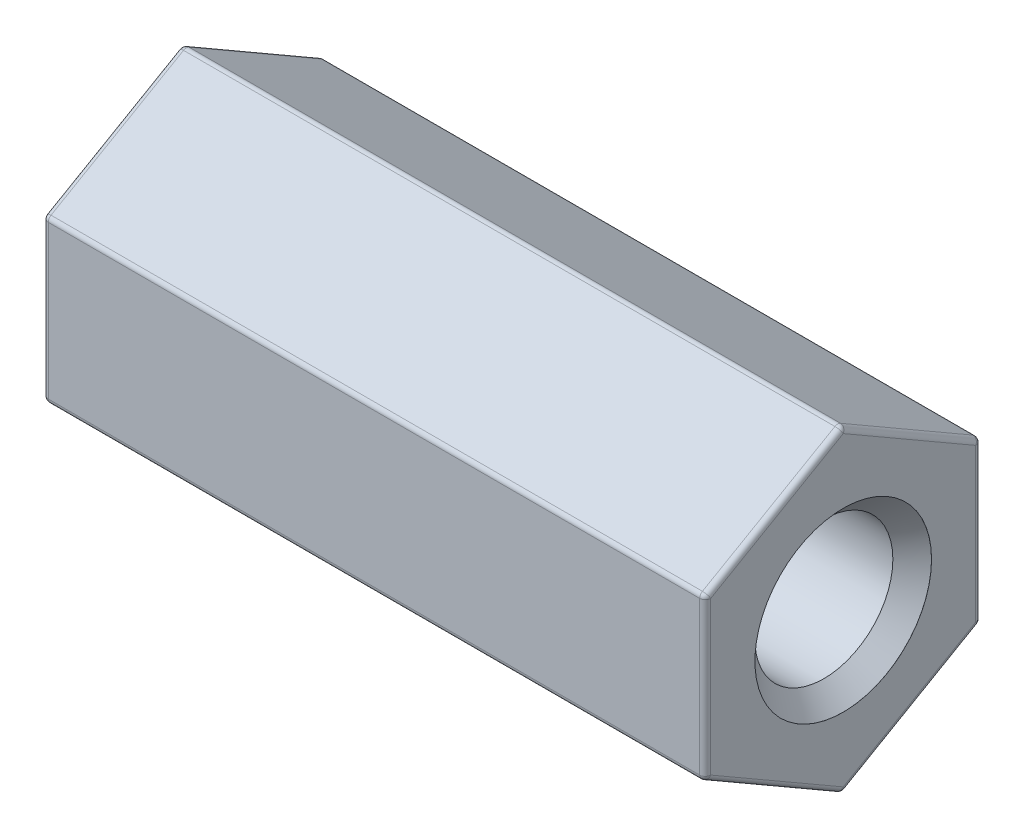
ISO-10303-21;
HEADER;
FILE_DESCRIPTION(('STEP AP214'),'2;1');
FILE_NAME('part.step','',(''),(''),'','','');
FILE_SCHEMA(('AUTOMOTIVE_DESIGN { 1 0 10303 214 1 1 1 1 }'));
ENDSEC;
DATA;
#1=APPLICATION_CONTEXT('core data for automotive mechanical design processes');
#2=APPLICATION_PROTOCOL_DEFINITION('international standard','automotive_design',2000,#1);
#3=PRODUCT_CONTEXT('',#1,'mechanical');
#4=PRODUCT('Part','Part','',(#3));
#5=PRODUCT_RELATED_PRODUCT_CATEGORY('part','',(#4));
#6=PRODUCT_DEFINITION_FORMATION('','',#4);
#7=PRODUCT_DEFINITION_CONTEXT('part definition',#1,'design');
#8=PRODUCT_DEFINITION('design','',#6,#7);
#9=PRODUCT_DEFINITION_SHAPE('','',#8);
#10=(LENGTH_UNIT() NAMED_UNIT(*) SI_UNIT(.MILLI.,.METRE.));
#11=(NAMED_UNIT(*) PLANE_ANGLE_UNIT() SI_UNIT($,.RADIAN.));
#12=(NAMED_UNIT(*) SI_UNIT($,.STERADIAN.) SOLID_ANGLE_UNIT());
#13=UNCERTAINTY_MEASURE_WITH_UNIT(LENGTH_MEASURE(1.E-05),#10,'distance_accuracy_value','');
#14=(GEOMETRIC_REPRESENTATION_CONTEXT(3) GLOBAL_UNCERTAINTY_ASSIGNED_CONTEXT((#13)) GLOBAL_UNIT_ASSIGNED_CONTEXT((#10,
#11,#12)) REPRESENTATION_CONTEXT('',''));
#15=CARTESIAN_POINT('',(0.,0.,0.));
#16=DIRECTION('',(0.,0.,1.));
#17=DIRECTION('',(1.,0.,0.));
#18=AXIS2_PLACEMENT_3D('',#15,#16,#17);
#19=CARTESIAN_POINT('',(0.,2.88675134594813,0.));
#20=DIRECTION('',(0.,0.866025403784439,0.5));
#21=DIRECTION('',(0.,-0.5,0.866025403784439));
#22=AXIS2_PLACEMENT_3D('',#19,#20,#21);
#23=PLANE('',#22);
#24=DIRECTION('',(1.,0.,0.));
#25=VECTOR('',#24,1.);
#26=CARTESIAN_POINT('',(0.,1.47224318643355,2.45));
#27=LINE('',#26,#25);
#28=CARTESIAN_POINT('',(0.0999999999999998,1.47224318643355,2.45));
#29=VERTEX_POINT('',#28);
#30=CARTESIAN_POINT('',(11.9,1.47224318643355,2.45));
#31=VERTEX_POINT('',#30);
#32=EDGE_CURVE('E256',#29,#31,#27,.T.);
#33=ORIENTED_EDGE('',*,*,#32,.T.);
#34=DIRECTION('',(0.,-0.5,0.866025403784439));
#35=VECTOR('',#34,1.);
#36=CARTESIAN_POINT('',(11.9,2.88675134594813,0.));
#37=LINE('',#36,#35);
#38=CARTESIAN_POINT('',(11.9,2.85788383248865,0.0499999999999996));
#39=VERTEX_POINT('',#38);
#40=EDGE_CURVE('E175',#31,#39,#37,.F.);
#41=ORIENTED_EDGE('',*,*,#40,.T.);
#42=DIRECTION('',(1.,0.,0.));
#43=VECTOR('',#42,1.);
#44=CARTESIAN_POINT('',(0.,2.85788383248865,0.0499999999999996));
#45=LINE('',#44,#43);
#46=CARTESIAN_POINT('',(0.0999999999999998,2.85788383248865,0.0499999999999996));
#47=VERTEX_POINT('',#46);
#48=EDGE_CURVE('E258',#39,#47,#45,.F.);
#49=ORIENTED_EDGE('',*,*,#48,.T.);
#50=DIRECTION('',(0.,-0.5,0.866025403784439));
#51=VECTOR('',#50,1.);
#52=CARTESIAN_POINT('',(0.0999999999999998,1.44337567297407,2.5));
#53=LINE('',#52,#51);
#54=EDGE_CURVE('E254',#47,#29,#53,.T.);
#55=ORIENTED_EDGE('',*,*,#54,.T.);
#56=EDGE_LOOP('',(#33,#41,#49,#55));
#57=FACE_BOUND('',#56,.T.);
#58=ADVANCED_FACE('F32',(#57),#23,.T.);
#59=CARTESIAN_POINT('',(0.,1.44337567297407,-2.5));
#60=DIRECTION('',(0.,0.866025403784439,-0.5));
#61=DIRECTION('',(0.,0.5,0.866025403784439));
#62=AXIS2_PLACEMENT_3D('',#59,#60,#61);
#63=PLANE('',#62);
#64=DIRECTION('',(1.,0.,0.));
#65=VECTOR('',#64,1.);
#66=CARTESIAN_POINT('',(0.,2.85788383248865,-0.0499999999999997));
#67=LINE('',#66,#65);
#68=CARTESIAN_POINT('',(0.0999999999999998,2.85788383248865,-0.0499999999999998));
#69=VERTEX_POINT('',#68);
#70=CARTESIAN_POINT('',(11.9,2.85788383248865,-0.0499999999999998));
#71=VERTEX_POINT('',#70);
#72=EDGE_CURVE('E247',#69,#71,#67,.T.);
#73=ORIENTED_EDGE('',*,*,#72,.T.);
#74=DIRECTION('',(0.,0.5,0.866025403784439));
#75=VECTOR('',#74,1.);
#76=CARTESIAN_POINT('',(11.9,1.44337567297407,-2.5));
#77=LINE('',#76,#75);
#78=CARTESIAN_POINT('',(11.9,1.47224318643355,-2.45));
#79=VERTEX_POINT('',#78);
#80=EDGE_CURVE('E251',#71,#79,#77,.F.);
#81=ORIENTED_EDGE('',*,*,#80,.T.);
#82=DIRECTION('',(1.,0.,0.));
#83=VECTOR('',#82,1.);
#84=CARTESIAN_POINT('',(0.,1.47224318643355,-2.45));
#85=LINE('',#84,#83);
#86=CARTESIAN_POINT('',(0.0999999999999998,1.47224318643355,-2.45));
#87=VERTEX_POINT('',#86);
#88=EDGE_CURVE('E249',#79,#87,#85,.F.);
#89=ORIENTED_EDGE('',*,*,#88,.T.);
#90=DIRECTION('',(0.,0.5,0.866025403784439));
#91=VECTOR('',#90,1.);
#92=CARTESIAN_POINT('',(0.0999999999999998,2.88675134594813,0.));
#93=LINE('',#92,#91);
#94=EDGE_CURVE('E245',#87,#69,#93,.T.);
#95=ORIENTED_EDGE('',*,*,#94,.T.);
#96=EDGE_LOOP('',(#73,#81,#89,#95));
#97=FACE_BOUND('',#96,.T.);
#98=ADVANCED_FACE('F390',(#97),#63,.T.);
#99=CARTESIAN_POINT('',(0.,-1.44337567297407,-2.5));
#100=DIRECTION('',(0.,0.,-1.));
#101=DIRECTION('',(0.,1.,0.));
#102=AXIS2_PLACEMENT_3D('',#99,#100,#101);
#103=PLANE('',#102);
#104=DIRECTION('',(1.,0.,0.));
#105=VECTOR('',#104,1.);
#106=CARTESIAN_POINT('',(0.,1.3856406460551,-2.5));
#107=LINE('',#106,#105);
#108=CARTESIAN_POINT('',(0.0999999999999998,1.3856406460551,-2.5));
#109=VERTEX_POINT('',#108);
#110=CARTESIAN_POINT('',(11.9,1.3856406460551,-2.5));
#111=VERTEX_POINT('',#110);
#112=EDGE_CURVE('E216',#109,#111,#107,.T.);
#113=ORIENTED_EDGE('',*,*,#112,.T.);
#114=DIRECTION('',(0.,1.,0.));
#115=VECTOR('',#114,1.);
#116=CARTESIAN_POINT('',(11.9,-1.44337567297407,-2.5));
#117=LINE('',#116,#115);
#118=CARTESIAN_POINT('',(11.9,-1.3856406460551,-2.5));
#119=VERTEX_POINT('',#118);
#120=EDGE_CURVE('E220',#111,#119,#117,.F.);
#121=ORIENTED_EDGE('',*,*,#120,.T.);
#122=DIRECTION('',(1.,0.,0.));
#123=VECTOR('',#122,1.);
#124=CARTESIAN_POINT('',(0.,-1.3856406460551,-2.5));
#125=LINE('',#124,#123);
#126=CARTESIAN_POINT('',(0.0999999999999998,-1.3856406460551,-2.5));
#127=VERTEX_POINT('',#126);
#128=EDGE_CURVE('E218',#119,#127,#125,.F.);
#129=ORIENTED_EDGE('',*,*,#128,.T.);
#130=DIRECTION('',(0.,1.,0.));
#131=VECTOR('',#130,1.);
#132=CARTESIAN_POINT('',(0.0999999999999998,1.44337567297407,-2.5));
#133=LINE('',#132,#131);
#134=EDGE_CURVE('E214',#127,#109,#133,.T.);
#135=ORIENTED_EDGE('',*,*,#134,.T.);
#136=EDGE_LOOP('',(#113,#121,#129,#135));
#137=FACE_BOUND('',#136,.T.);
#138=ADVANCED_FACE('F396',(#137),#103,.T.);
#139=CARTESIAN_POINT('',(0.,-2.88675134594813,0.));
#140=DIRECTION('',(0.,-0.866025403784439,-0.5));
#141=DIRECTION('',(0.,0.5,-0.866025403784439));
#142=AXIS2_PLACEMENT_3D('',#139,#140,#141);
#143=PLANE('',#142);
#144=DIRECTION('',(1.,0.,0.));
#145=VECTOR('',#144,1.);
#146=CARTESIAN_POINT('',(0.,-1.47224318643355,-2.45));
#147=LINE('',#146,#145);
#148=CARTESIAN_POINT('',(0.0999999999999998,-1.47224318643355,-2.45));
#149=VERTEX_POINT('',#148);
#150=CARTESIAN_POINT('',(11.9,-1.47224318643355,-2.45));
#151=VERTEX_POINT('',#150);
#152=EDGE_CURVE('E209',#149,#151,#147,.T.);
#153=ORIENTED_EDGE('',*,*,#152,.T.);
#154=DIRECTION('',(0.,0.5,-0.866025403784439));
#155=VECTOR('',#154,1.);
#156=CARTESIAN_POINT('',(11.9,-2.88675134594813,0.));
#157=LINE('',#156,#155);
#158=CARTESIAN_POINT('',(11.9,-2.85788383248865,-0.0499999999999996));
#159=VERTEX_POINT('',#158);
#160=EDGE_CURVE('E211',#151,#159,#157,.F.);
#161=ORIENTED_EDGE('',*,*,#160,.T.);
#162=DIRECTION('',(1.,0.,0.));
#163=VECTOR('',#162,1.);
#164=CARTESIAN_POINT('',(0.,-2.85788383248865,-0.0499999999999996));
#165=LINE('',#164,#163);
#166=CARTESIAN_POINT('',(0.0999999999999998,-2.85788383248865,-0.0499999999999997));
#167=VERTEX_POINT('',#166);
#168=EDGE_CURVE('E207',#159,#167,#165,.F.);
#169=ORIENTED_EDGE('',*,*,#168,.T.);
#170=DIRECTION('',(0.,0.5,-0.866025403784439));
#171=VECTOR('',#170,1.);
#172=CARTESIAN_POINT('',(0.0999999999999998,-1.44337567297407,-2.5));
#173=LINE('',#172,#171);
#174=EDGE_CURVE('E205',#167,#149,#173,.T.);
#175=ORIENTED_EDGE('',*,*,#174,.T.);
#176=EDGE_LOOP('',(#153,#161,#169,#175));
#177=FACE_BOUND('',#176,.T.);
#178=ADVANCED_FACE('F568',(#177),#143,.T.);
#179=CARTESIAN_POINT('',(0.,-1.44337567297407,2.5));
#180=DIRECTION('',(0.,-0.866025403784439,0.5));
#181=DIRECTION('',(0.,-0.5,-0.866025403784439));
#182=AXIS2_PLACEMENT_3D('',#179,#180,#181);
#183=PLANE('',#182);
#184=DIRECTION('',(1.,0.,0.));
#185=VECTOR('',#184,1.);
#186=CARTESIAN_POINT('',(0.,-2.85788383248865,0.0500000000000001));
#187=LINE('',#186,#185);
#188=CARTESIAN_POINT('',(0.0999999999999998,-2.85788383248865,0.0500000000000002));
#189=VERTEX_POINT('',#188);
#190=CARTESIAN_POINT('',(11.9,-2.85788383248865,0.0500000000000002));
#191=VERTEX_POINT('',#190);
#192=EDGE_CURVE('E227',#189,#191,#187,.T.);
#193=ORIENTED_EDGE('',*,*,#192,.T.);
#194=DIRECTION('',(0.,-0.5,-0.866025403784439));
#195=VECTOR('',#194,1.);
#196=CARTESIAN_POINT('',(11.9,-1.44337567297407,2.5));
#197=LINE('',#196,#195);
#198=CARTESIAN_POINT('',(11.9,-1.47224318643355,2.45));
#199=VERTEX_POINT('',#198);
#200=EDGE_CURVE('E229',#191,#199,#197,.F.);
#201=ORIENTED_EDGE('',*,*,#200,.T.);
#202=DIRECTION('',(1.,0.,0.));
#203=VECTOR('',#202,1.);
#204=CARTESIAN_POINT('',(0.,-1.47224318643355,2.45));
#205=LINE('',#204,#203);
#206=CARTESIAN_POINT('',(0.0999999999999998,-1.47224318643355,2.45));
#207=VERTEX_POINT('',#206);
#208=EDGE_CURVE('E225',#199,#207,#205,.F.);
#209=ORIENTED_EDGE('',*,*,#208,.T.);
#210=DIRECTION('',(0.,-0.5,-0.866025403784439));
#211=VECTOR('',#210,1.);
#212=CARTESIAN_POINT('',(0.0999999999999998,-2.88675134594813,0.));
#213=LINE('',#212,#211);
#214=EDGE_CURVE('E223',#207,#189,#213,.T.);
#215=ORIENTED_EDGE('',*,*,#214,.T.);
#216=EDGE_LOOP('',(#193,#201,#209,#215));
#217=FACE_BOUND('',#216,.T.);
#218=ADVANCED_FACE('F529',(#217),#183,.T.);
#219=CARTESIAN_POINT('',(0.,1.44337567297407,2.5));
#220=DIRECTION('',(0.,0.,1.));
#221=DIRECTION('',(1.,0.,0.));
#222=AXIS2_PLACEMENT_3D('',#219,#220,#221);
#223=PLANE('',#222);
#224=DIRECTION('',(1.,0.,0.));
#225=VECTOR('',#224,1.);
#226=CARTESIAN_POINT('',(0.,-1.3856406460551,2.5));
#227=LINE('',#226,#225);
#228=CARTESIAN_POINT('',(0.0999999999999998,-1.3856406460551,2.5));
#229=VERTEX_POINT('',#228);
#230=CARTESIAN_POINT('',(11.9,-1.3856406460551,2.5));
#231=VERTEX_POINT('',#230);
#232=EDGE_CURVE('E41',#229,#231,#227,.T.);
#233=ORIENTED_EDGE('',*,*,#232,.T.);
#234=DIRECTION('',(0.,-1.,0.));
#235=VECTOR('',#234,1.);
#236=CARTESIAN_POINT('',(11.9,1.44337567297407,2.5));
#237=LINE('',#236,#235);
#238=CARTESIAN_POINT('',(11.9,1.3856406460551,2.5));
#239=VERTEX_POINT('',#238);
#240=EDGE_CURVE('E11',#231,#239,#237,.F.);
#241=ORIENTED_EDGE('',*,*,#240,.T.);
#242=DIRECTION('',(1.,0.,0.));
#243=VECTOR('',#242,1.);
#244=CARTESIAN_POINT('',(0.,1.3856406460551,2.5));
#245=LINE('',#244,#243);
#246=CARTESIAN_POINT('',(0.0999999999999998,1.3856406460551,2.5));
#247=VERTEX_POINT('',#246);
#248=EDGE_CURVE('E263',#239,#247,#245,.F.);
#249=ORIENTED_EDGE('',*,*,#248,.T.);
#250=DIRECTION('',(0.,-1.,0.));
#251=VECTOR('',#250,1.);
#252=CARTESIAN_POINT('',(0.0999999999999998,-1.44337567297407,2.5));
#253=LINE('',#252,#251);
#254=EDGE_CURVE('E261',#247,#229,#253,.T.);
#255=ORIENTED_EDGE('',*,*,#254,.T.);
#256=EDGE_LOOP('',(#233,#241,#249,#255));
#257=FACE_BOUND('',#256,.T.);
#258=ADVANCED_FACE('F385',(#257),#223,.T.);
#259=CARTESIAN_POINT('',(0.,0.,0.));
#260=DIRECTION('',(1.,0.,0.));
#261=DIRECTION('',(0.,0.,-1.));
#262=AXIS2_PLACEMENT_3D('',#259,#260,#261);
#263=PLANE('',#262);
#264=DIRECTION('',(0.,1.,0.));
#265=VECTOR('',#264,1.);
#266=CARTESIAN_POINT('',(0.,-1.44337567297407,-2.4));
#267=LINE('',#266,#265);
#268=CARTESIAN_POINT('',(0.,1.3856406460551,-2.4));
#269=VERTEX_POINT('',#268);
#270=CARTESIAN_POINT('',(0.,-1.3856406460551,-2.4));
#271=VERTEX_POINT('',#270);
#272=EDGE_CURVE('E240',#269,#271,#267,.F.);
#273=ORIENTED_EDGE('',*,*,#272,.T.);
#274=DIRECTION('',(0.,0.5,-0.866025403784439));
#275=VECTOR('',#274,1.);
#276=CARTESIAN_POINT('',(0.,-2.80014880556969,0.0499999999999999));
#277=LINE('',#276,#275);
#278=CARTESIAN_POINT('',(0.,-2.77128129211021,0.));
#279=VERTEX_POINT('',#278);
#280=EDGE_CURVE('E242',#271,#279,#277,.F.);
#281=ORIENTED_EDGE('',*,*,#280,.T.);
#282=DIRECTION('',(0.,-0.5,-0.866025403784439));
#283=VECTOR('',#282,1.);
#284=CARTESIAN_POINT('',(0.,-1.35677313259562,2.45));
#285=LINE('',#284,#283);
#286=CARTESIAN_POINT('',(0.,-1.3856406460551,2.4));
#287=VERTEX_POINT('',#286);
#288=EDGE_CURVE('E238',#279,#287,#285,.F.);
#289=ORIENTED_EDGE('',*,*,#288,.T.);
#290=DIRECTION('',(0.,-1.,0.));
#291=VECTOR('',#290,1.);
#292=CARTESIAN_POINT('',(0.,1.44337567297407,2.4));
#293=LINE('',#292,#291);
#294=CARTESIAN_POINT('',(0.,1.3856406460551,2.4));
#295=VERTEX_POINT('',#294);
#296=EDGE_CURVE('E234',#287,#295,#293,.F.);
#297=ORIENTED_EDGE('',*,*,#296,.T.);
#298=DIRECTION('',(0.,-0.5,0.866025403784439));
#299=VECTOR('',#298,1.);
#300=CARTESIAN_POINT('',(0.,2.80014880556969,-0.0500000000000002));
#301=LINE('',#300,#299);
#302=CARTESIAN_POINT('',(0.,2.77128129211021,0.));
#303=VERTEX_POINT('',#302);
#304=EDGE_CURVE('E232',#295,#303,#301,.F.);
#305=ORIENTED_EDGE('',*,*,#304,.T.);
#306=DIRECTION('',(0.,0.5,0.866025403784439));
#307=VECTOR('',#306,1.);
#308=CARTESIAN_POINT('',(0.,1.35677313259562,-2.45));
#309=LINE('',#308,#307);
#310=EDGE_CURVE('E236',#303,#269,#309,.F.);
#311=ORIENTED_EDGE('',*,*,#310,.T.);
#312=EDGE_LOOP('',(#273,#281,#289,#297,#305,#311));
#313=FACE_BOUND('',#312,.T.);
#314=CARTESIAN_POINT('',(0.,5.31141630952036E-11,0.));
#315=DIRECTION('',(1.,0.,0.));
#316=DIRECTION('',(0.,0.,-1.));
#317=AXIS2_PLACEMENT_3D('',#314,#315,#316);
#318=CIRCLE('',#317,1.6);
#319=CARTESIAN_POINT('',(0.,5.31141630952036E-11,-1.6));
#320=VERTEX_POINT('',#319);
#321=EDGE_CURVE('E190',#320,#320,#318,.T.);
#322=ORIENTED_EDGE('',*,*,#321,.T.);
#323=EDGE_LOOP('',(#322));
#324=FACE_BOUND('',#323,.T.);
#325=ADVANCED_FACE('F377',(#313,#324),#263,.F.);
#326=CARTESIAN_POINT('',(12.,0.,0.));
#327=DIRECTION('',(1.,0.,0.));
#328=DIRECTION('',(0.,0.,-1.));
#329=AXIS2_PLACEMENT_3D('',#326,#327,#328);
#330=PLANE('',#329);
#331=DIRECTION('',(0.,-0.5,-0.866025403784439));
#332=VECTOR('',#331,1.);
#333=CARTESIAN_POINT('',(12.,-2.07846096908265,1.2));
#334=LINE('',#333,#332);
#335=CARTESIAN_POINT('',(12.,-1.3856406460551,2.4));
#336=VERTEX_POINT('',#335);
#337=CARTESIAN_POINT('',(12.,-2.77128129211021,0.));
#338=VERTEX_POINT('',#337);
#339=EDGE_CURVE('E198',#336,#338,#334,.T.);
#340=ORIENTED_EDGE('',*,*,#339,.T.);
#341=DIRECTION('',(0.,0.5,-0.866025403784439));
#342=VECTOR('',#341,1.);
#343=CARTESIAN_POINT('',(12.,-2.07846096908265,-1.2));
#344=LINE('',#343,#342);
#345=CARTESIAN_POINT('',(12.,-1.3856406460551,-2.4));
#346=VERTEX_POINT('',#345);
#347=EDGE_CURVE('E202',#338,#346,#344,.T.);
#348=ORIENTED_EDGE('',*,*,#347,.T.);
#349=DIRECTION('',(0.,1.,0.));
#350=VECTOR('',#349,1.);
#351=CARTESIAN_POINT('',(12.,0.,-2.4));
#352=LINE('',#351,#350);
#353=CARTESIAN_POINT('',(12.,1.3856406460551,-2.4));
#354=VERTEX_POINT('',#353);
#355=EDGE_CURVE('E200',#346,#354,#352,.T.);
#356=ORIENTED_EDGE('',*,*,#355,.T.);
#357=DIRECTION('',(0.,0.5,0.866025403784439));
#358=VECTOR('',#357,1.);
#359=CARTESIAN_POINT('',(12.,2.07846096908265,-1.2));
#360=LINE('',#359,#358);
#361=CARTESIAN_POINT('',(12.,2.77128129211021,0.));
#362=VERTEX_POINT('',#361);
#363=EDGE_CURVE('E165',#354,#362,#360,.T.);
#364=ORIENTED_EDGE('',*,*,#363,.T.);
#365=DIRECTION('',(0.,-0.5,0.866025403784439));
#366=VECTOR('',#365,1.);
#367=CARTESIAN_POINT('',(12.,2.07846096908265,1.2));
#368=LINE('',#367,#366);
#369=CARTESIAN_POINT('',(12.,1.3856406460551,2.4));
#370=VERTEX_POINT('',#369);
#371=EDGE_CURVE('E158',#362,#370,#368,.T.);
#372=ORIENTED_EDGE('',*,*,#371,.T.);
#373=DIRECTION('',(0.,-1.,0.));
#374=VECTOR('',#373,1.);
#375=CARTESIAN_POINT('',(12.,0.,2.4));
#376=LINE('',#375,#374);
#377=EDGE_CURVE('E162',#370,#336,#376,.T.);
#378=ORIENTED_EDGE('',*,*,#377,.T.);
#379=EDGE_LOOP('',(#340,#348,#356,#364,#372,#378));
#380=FACE_BOUND('',#379,.T.);
#381=CARTESIAN_POINT('',(12.,5.31141630952036E-11,0.));
#382=DIRECTION('',(1.,0.,0.));
#383=DIRECTION('',(0.,0.,-1.));
#384=AXIS2_PLACEMENT_3D('',#381,#382,#383);
#385=CIRCLE('',#384,1.6);
#386=CARTESIAN_POINT('',(12.,5.31141630952036E-11,-1.6));
#387=VERTEX_POINT('',#386);
#388=EDGE_CURVE('E193',#387,#387,#385,.T.);
#389=ORIENTED_EDGE('',*,*,#388,.F.);
#390=EDGE_LOOP('',(#389));
#391=FACE_BOUND('',#390,.T.);
#392=ADVANCED_FACE('F160',(#380,#391),#330,.T.);
#393=CARTESIAN_POINT('',(0.,5.31141630952036E-11,0.));
#394=DIRECTION('',(1.,0.,0.));
#395=DIRECTION('',(0.,0.,-1.));
#396=AXIS2_PLACEMENT_3D('',#393,#394,#395);
#397=CYLINDRICAL_SURFACE('',#396,1.6);
#398=ORIENTED_EDGE('',*,*,#321,.F.);
#399=EDGE_LOOP('',(#398));
#400=FACE_BOUND('',#399,.T.);
#401=CARTESIAN_POINT('',(0.00100000005431823,5.31141630952036E-11,0.));
#402=DIRECTION('',(1.,0.,0.));
#403=DIRECTION('',(0.,0.,-1.));
#404=AXIS2_PLACEMENT_3D('',#401,#402,#403);
#405=CIRCLE('',#404,1.6);
#406=CARTESIAN_POINT('',(0.00100000005431823,5.31141630952036E-11,-1.6));
#407=VERTEX_POINT('',#406);
#408=EDGE_CURVE('E353',#407,#407,#405,.T.);
#409=ORIENTED_EDGE('',*,*,#408,.T.);
#410=EDGE_LOOP('',(#409));
#411=FACE_BOUND('',#410,.T.);
#412=ADVANCED_FACE('F376',(#400,#411),#397,.F.);
#413=CARTESIAN_POINT('',(0.,5.31141630952036E-11,0.));
#414=DIRECTION('',(1.,0.,0.));
#415=DIRECTION('',(0.,0.,-1.));
#416=AXIS2_PLACEMENT_3D('',#413,#414,#415);
#417=CYLINDRICAL_SURFACE('',#416,1.6);
#418=CARTESIAN_POINT('',(11.9990000000818,5.31141630952036E-11,0.));
#419=DIRECTION('',(1.,0.,0.));
#420=DIRECTION('',(0.,0.,-1.));
#421=AXIS2_PLACEMENT_3D('',#418,#419,#420);
#422=CIRCLE('',#421,1.6);
#423=CARTESIAN_POINT('',(11.9990000000818,5.31141630952036E-11,-1.6));
#424=VERTEX_POINT('',#423);
#425=EDGE_CURVE('E369',#424,#424,#422,.T.);
#426=ORIENTED_EDGE('',*,*,#425,.F.);
#427=EDGE_LOOP('',(#426));
#428=FACE_BOUND('',#427,.T.);
#429=ORIENTED_EDGE('',*,*,#388,.T.);
#430=EDGE_LOOP('',(#429));
#431=FACE_BOUND('',#430,.T.);
#432=ADVANCED_FACE('F374',(#428,#431),#417,.F.);
#433=CARTESIAN_POINT('',(11.9990000000818,5.31141630952036E-11,0.));
#434=DIRECTION('',(1.,0.,0.));
#435=DIRECTION('',(0.,0.,-1.));
#436=AXIS2_PLACEMENT_3D('',#433,#434,#435);
#437=CONICAL_SURFACE('',#436,1.6,0.785398163356525);
#438=CARTESIAN_POINT('',(11.6490000000537,5.31141630952036E-11,0.));
#439=DIRECTION('',(1.,0.,0.));
#440=DIRECTION('',(0.,0.,-1.));
#441=AXIS2_PLACEMENT_3D('',#438,#439,#440);
#442=CIRCLE('',#441,1.2500000000006);
#443=CARTESIAN_POINT('',(11.6490000000537,5.31141630952036E-11,-1.2500000000006));
#444=VERTEX_POINT('',#443);
#445=EDGE_CURVE('E364',#444,#444,#442,.T.);
#446=ORIENTED_EDGE('',*,*,#445,.F.);
#447=EDGE_LOOP('',(#446));
#448=FACE_BOUND('',#447,.T.);
#449=ORIENTED_EDGE('',*,*,#425,.T.);
#450=EDGE_LOOP('',(#449));
#451=FACE_BOUND('',#450,.T.);
#452=ADVANCED_FACE('F786',(#448,#451),#437,.F.);
#453=CARTESIAN_POINT('',(0.,5.31141630952036E-11,0.));
#454=DIRECTION('',(1.,0.,0.));
#455=DIRECTION('',(0.,0.,-1.));
#456=AXIS2_PLACEMENT_3D('',#453,#454,#455);
#457=CYLINDRICAL_SURFACE('',#456,1.2500000000006);
#458=CARTESIAN_POINT('',(0.351000000053722,5.31141630952036E-11,0.));
#459=DIRECTION('',(1.,0.,0.));
#460=DIRECTION('',(0.,0.,-1.));
#461=AXIS2_PLACEMENT_3D('',#458,#459,#460);
#462=CIRCLE('',#461,1.2500000000006);
#463=CARTESIAN_POINT('',(0.351000000053722,5.31141630952036E-11,-1.2500000000006));
#464=VERTEX_POINT('',#463);
#465=EDGE_CURVE('E359',#464,#464,#462,.T.);
#466=ORIENTED_EDGE('',*,*,#465,.F.);
#467=EDGE_LOOP('',(#466));
#468=FACE_BOUND('',#467,.T.);
#469=ORIENTED_EDGE('',*,*,#445,.T.);
#470=EDGE_LOOP('',(#469));
#471=FACE_BOUND('',#470,.T.);
#472=ADVANCED_FACE('F779',(#468,#471),#457,.F.);
#473=CARTESIAN_POINT('',(0.351000000053722,5.31141630952036E-11,0.));
#474=DIRECTION('',(-1.,0.,0.));
#475=DIRECTION('',(0.,0.,1.));
#476=AXIS2_PLACEMENT_3D('',#473,#474,#475);
#477=CONICAL_SURFACE('',#476,1.2500000000006,0.785398163397448);
#478=ORIENTED_EDGE('',*,*,#408,.F.);
#479=EDGE_LOOP('',(#478));
#480=FACE_BOUND('',#479,.T.);
#481=ORIENTED_EDGE('',*,*,#465,.T.);
#482=EDGE_LOOP('',(#481));
#483=FACE_BOUND('',#482,.T.);
#484=ADVANCED_FACE('F510',(#480,#483),#477,.F.);
#485=CARTESIAN_POINT('',(0.0999999999999998,2.80014880556969,-0.0500000000000002));
#486=DIRECTION('',(0.,0.5,-0.866025403784439));
#487=DIRECTION('',(0.,0.866025403784439,0.5));
#488=AXIS2_PLACEMENT_3D('',#485,#486,#487);
#489=CYLINDRICAL_SURFACE('',#488,0.0999999999999998);
#490=CARTESIAN_POINT('',(0.0999999999999998,1.3856406460551,2.4));
#491=DIRECTION('',(0.,-0.499999999999999,0.86602540378444));
#492=DIRECTION('',(0.,-0.86602540378444,-0.499999999999999));
#493=AXIS2_PLACEMENT_3D('',#490,#491,#492);
#494=CIRCLE('',#493,0.0999999999999998);
#495=EDGE_CURVE('E36',#29,#295,#494,.T.);
#496=ORIENTED_EDGE('',*,*,#495,.F.);
#497=ORIENTED_EDGE('',*,*,#54,.F.);
#498=CARTESIAN_POINT('',(0.0999999999999998,2.77128129211021,0.));
#499=DIRECTION('',(0.,0.499999999999999,-0.866025403784439));
#500=DIRECTION('',(0.,0.866025403784439,0.499999999999999));
#501=AXIS2_PLACEMENT_3D('',#498,#499,#500);
#502=CIRCLE('',#501,0.0999999999999998);
#503=EDGE_CURVE('E346',#303,#47,#502,.T.);
#504=ORIENTED_EDGE('',*,*,#503,.F.);
#505=ORIENTED_EDGE('',*,*,#304,.F.);
#506=EDGE_LOOP('',(#496,#497,#504,#505));
#507=FACE_BOUND('',#506,.T.);
#508=ADVANCED_FACE('F34',(#507),#489,.T.);
#509=CARTESIAN_POINT('',(0.0999999999999998,1.3856406460551,2.4));
#510=DIRECTION('',(0.,0.,1.));
#511=DIRECTION('',(1.,0.,0.));
#512=AXIS2_PLACEMENT_3D('',#509,#510,#511);
#513=SPHERICAL_SURFACE('',#512,0.0999999999999998);
#514=CARTESIAN_POINT('',(0.0999999999999998,1.3856406460551,2.4));
#515=DIRECTION('',(-1.,0.,0.));
#516=DIRECTION('',(0.,0.,1.));
#517=AXIS2_PLACEMENT_3D('',#514,#515,#516);
#518=CIRCLE('',#517,0.0999999999999998);
#519=EDGE_CURVE('E341',#29,#247,#518,.F.);
#520=ORIENTED_EDGE('',*,*,#519,.F.);
#521=ORIENTED_EDGE('',*,*,#495,.T.);
#522=CARTESIAN_POINT('',(0.0999999999999998,1.3856406460551,2.4));
#523=DIRECTION('',(0.,1.,0.));
#524=DIRECTION('',(0.,0.,1.));
#525=AXIS2_PLACEMENT_3D('',#522,#523,#524);
#526=CIRCLE('',#525,0.0999999999999998);
#527=EDGE_CURVE('E344',#247,#295,#526,.F.);
#528=ORIENTED_EDGE('',*,*,#527,.F.);
#529=EDGE_LOOP('',(#520,#521,#528));
#530=FACE_BOUND('',#529,.T.);
#531=ADVANCED_FACE('F505',(#530),#513,.T.);
#532=CARTESIAN_POINT('',(0.0999999999999998,2.77128129211021,0.));
#533=DIRECTION('',(0.,0.,1.));
#534=DIRECTION('',(1.,0.,0.));
#535=AXIS2_PLACEMENT_3D('',#532,#533,#534);
#536=SPHERICAL_SURFACE('',#535,0.0999999999999998);
#537=CARTESIAN_POINT('',(0.0999999999999998,2.77128129211021,0.));
#538=DIRECTION('',(0.,0.5,0.866025403784439));
#539=DIRECTION('',(0.,-0.866025403784439,0.5));
#540=AXIS2_PLACEMENT_3D('',#537,#538,#539);
#541=CIRCLE('',#540,0.0999999999999998);
#542=EDGE_CURVE('E335',#303,#69,#541,.F.);
#543=ORIENTED_EDGE('',*,*,#542,.F.);
#544=ORIENTED_EDGE('',*,*,#503,.T.);
#545=CARTESIAN_POINT('',(0.0999999999999998,2.77128129211021,0.));
#546=DIRECTION('',(-1.,0.,0.));
#547=DIRECTION('',(0.,0.,1.));
#548=AXIS2_PLACEMENT_3D('',#545,#546,#547);
#549=CIRCLE('',#548,0.0999999999999998);
#550=EDGE_CURVE('E338',#69,#47,#549,.F.);
#551=ORIENTED_EDGE('',*,*,#550,.F.);
#552=EDGE_LOOP('',(#543,#544,#551));
#553=FACE_BOUND('',#552,.T.);
#554=ADVANCED_FACE('F502',(#553),#536,.T.);
#555=CARTESIAN_POINT('',(0.0999999999999998,1.44337567297407,2.4));
#556=DIRECTION('',(0.,1.,0.));
#557=DIRECTION('',(0.,0.,1.));
#558=AXIS2_PLACEMENT_3D('',#555,#556,#557);
#559=CYLINDRICAL_SURFACE('',#558,0.0999999999999998);
#560=ORIENTED_EDGE('',*,*,#527,.T.);
#561=ORIENTED_EDGE('',*,*,#296,.F.);
#562=CARTESIAN_POINT('',(0.0999999999999998,-1.3856406460551,2.4));
#563=DIRECTION('',(0.,-1.,0.));
#564=DIRECTION('',(1.,0.,0.));
#565=AXIS2_PLACEMENT_3D('',#562,#563,#564);
#566=CIRCLE('',#565,0.0999999999999998);
#567=EDGE_CURVE('E332',#229,#287,#566,.T.);
#568=ORIENTED_EDGE('',*,*,#567,.F.);
#569=ORIENTED_EDGE('',*,*,#254,.F.);
#570=EDGE_LOOP('',(#560,#561,#568,#569));
#571=FACE_BOUND('',#570,.T.);
#572=ADVANCED_FACE('F498',(#571),#559,.T.);
#573=CARTESIAN_POINT('',(0.,1.3856406460551,2.4));
#574=DIRECTION('',(1.,0.,0.));
#575=DIRECTION('',(0.,0.,-1.));
#576=AXIS2_PLACEMENT_3D('',#573,#574,#575);
#577=CYLINDRICAL_SURFACE('',#576,0.0999999999999998);
#578=ORIENTED_EDGE('',*,*,#519,.T.);
#579=ORIENTED_EDGE('',*,*,#248,.F.);
#580=CARTESIAN_POINT('',(11.9,1.3856406460551,2.4));
#581=DIRECTION('',(1.,0.,0.));
#582=DIRECTION('',(0.,0.,-1.));
#583=AXIS2_PLACEMENT_3D('',#580,#581,#582);
#584=CIRCLE('',#583,0.0999999999999998);
#585=EDGE_CURVE('E178',#31,#239,#584,.T.);
#586=ORIENTED_EDGE('',*,*,#585,.F.);
#587=ORIENTED_EDGE('',*,*,#32,.F.);
#588=EDGE_LOOP('',(#578,#579,#586,#587));
#589=FACE_BOUND('',#588,.T.);
#590=ADVANCED_FACE('F495',(#589),#577,.T.);
#591=CARTESIAN_POINT('',(11.9,2.07846096908265,1.2));
#592=DIRECTION('',(0.,-0.5,0.866025403784439));
#593=DIRECTION('',(0.,-0.866025403784439,-0.5));
#594=AXIS2_PLACEMENT_3D('',#591,#592,#593);
#595=CYLINDRICAL_SURFACE('',#594,0.0999999999999998);
#596=CARTESIAN_POINT('',(11.9,2.77128129211021,0.));
#597=DIRECTION('',(0.,0.5,-0.866025403784439));
#598=DIRECTION('',(0.,0.866025403784439,0.5));
#599=AXIS2_PLACEMENT_3D('',#596,#597,#598);
#600=CIRCLE('',#599,0.0999999999999998);
#601=EDGE_CURVE('E179',#39,#362,#600,.T.);
#602=ORIENTED_EDGE('',*,*,#601,.F.);
#603=ORIENTED_EDGE('',*,*,#40,.F.);
#604=CARTESIAN_POINT('',(11.9,1.3856406460551,2.4));
#605=DIRECTION('',(0.,-0.499999999999998,0.86602540378444));
#606=DIRECTION('',(0.,-0.86602540378444,-0.499999999999998));
#607=AXIS2_PLACEMENT_3D('',#604,#605,#606);
#608=CIRCLE('',#607,0.0999999999999998);
#609=EDGE_CURVE('E172',#370,#31,#608,.T.);
#610=ORIENTED_EDGE('',*,*,#609,.F.);
#611=ORIENTED_EDGE('',*,*,#371,.F.);
#612=EDGE_LOOP('',(#602,#603,#610,#611));
#613=FACE_BOUND('',#612,.T.);
#614=ADVANCED_FACE('F173',(#613),#595,.T.);
#615=CARTESIAN_POINT('',(0.,2.77128129211021,0.));
#616=DIRECTION('',(1.,0.,0.));
#617=DIRECTION('',(0.,0.,-1.));
#618=AXIS2_PLACEMENT_3D('',#615,#616,#617);
#619=CYLINDRICAL_SURFACE('',#618,0.0999999999999998);
#620=ORIENTED_EDGE('',*,*,#550,.T.);
#621=ORIENTED_EDGE('',*,*,#48,.F.);
#622=CARTESIAN_POINT('',(11.9,2.77128129211021,0.));
#623=DIRECTION('',(1.,0.,0.));
#624=DIRECTION('',(0.,0.,-1.));
#625=AXIS2_PLACEMENT_3D('',#622,#623,#624);
#626=CIRCLE('',#625,0.0999999999999998);
#627=EDGE_CURVE('E328',#71,#39,#626,.T.);
#628=ORIENTED_EDGE('',*,*,#627,.F.);
#629=ORIENTED_EDGE('',*,*,#72,.F.);
#630=EDGE_LOOP('',(#620,#621,#628,#629));
#631=FACE_BOUND('',#630,.T.);
#632=ADVANCED_FACE('F488',(#631),#619,.T.);
#633=CARTESIAN_POINT('',(0.0999999999999998,1.35677313259562,-2.45));
#634=DIRECTION('',(0.,-0.5,-0.866025403784439));
#635=DIRECTION('',(0.,0.866025403784439,-0.5));
#636=AXIS2_PLACEMENT_3D('',#633,#634,#635);
#637=CYLINDRICAL_SURFACE('',#636,0.0999999999999998);
#638=ORIENTED_EDGE('',*,*,#542,.T.);
#639=ORIENTED_EDGE('',*,*,#94,.F.);
#640=CARTESIAN_POINT('',(0.0999999999999998,1.3856406460551,-2.4));
#641=DIRECTION('',(0.,-0.5,-0.866025403784439));
#642=DIRECTION('',(0.,0.866025403784439,-0.5));
#643=AXIS2_PLACEMENT_3D('',#640,#641,#642);
#644=CIRCLE('',#643,0.0999999999999998);
#645=EDGE_CURVE('E325',#269,#87,#644,.T.);
#646=ORIENTED_EDGE('',*,*,#645,.F.);
#647=ORIENTED_EDGE('',*,*,#310,.F.);
#648=EDGE_LOOP('',(#638,#639,#646,#647));
#649=FACE_BOUND('',#648,.T.);
#650=ADVANCED_FACE('F484',(#649),#637,.T.);
#651=CARTESIAN_POINT('',(0.0999999999999998,-1.3856406460551,2.4));
#652=DIRECTION('',(0.,0.,1.));
#653=DIRECTION('',(1.,0.,0.));
#654=AXIS2_PLACEMENT_3D('',#651,#652,#653);
#655=SPHERICAL_SURFACE('',#654,0.0999999999999998);
#656=CARTESIAN_POINT('',(0.0999999999999998,-1.3856406460551,2.4));
#657=DIRECTION('',(-1.,0.,0.));
#658=DIRECTION('',(0.,0.,1.));
#659=AXIS2_PLACEMENT_3D('',#656,#657,#658);
#660=CIRCLE('',#659,0.0999999999999998);
#661=EDGE_CURVE('E183',#229,#207,#660,.F.);
#662=ORIENTED_EDGE('',*,*,#661,.F.);
#663=ORIENTED_EDGE('',*,*,#567,.T.);
#664=CARTESIAN_POINT('',(0.0999999999999998,-1.3856406460551,2.4));
#665=DIRECTION('',(0.,0.5,0.866025403784439));
#666=DIRECTION('',(0.,-0.866025403784439,0.5));
#667=AXIS2_PLACEMENT_3D('',#664,#665,#666);
#668=CIRCLE('',#667,0.0999999999999998);
#669=EDGE_CURVE('E322',#207,#287,#668,.F.);
#670=ORIENTED_EDGE('',*,*,#669,.F.);
#671=EDGE_LOOP('',(#662,#663,#670));
#672=FACE_BOUND('',#671,.T.);
#673=ADVANCED_FACE('F481',(#672),#655,.T.);
#674=CARTESIAN_POINT('',(11.9,1.3856406460551,2.4));
#675=DIRECTION('',(0.,0.,1.));
#676=DIRECTION('',(1.,0.,0.));
#677=AXIS2_PLACEMENT_3D('',#674,#675,#676);
#678=SPHERICAL_SURFACE('',#677,0.0999999999999998);
#679=ORIENTED_EDGE('',*,*,#609,.T.);
#680=ORIENTED_EDGE('',*,*,#585,.T.);
#681=CARTESIAN_POINT('',(11.9,1.3856406460551,2.4));
#682=DIRECTION('',(0.,1.,0.));
#683=DIRECTION('',(-1.,0.,0.));
#684=AXIS2_PLACEMENT_3D('',#681,#682,#683);
#685=CIRCLE('',#684,0.0999999999999998);
#686=EDGE_CURVE('E54',#370,#239,#685,.F.);
#687=ORIENTED_EDGE('',*,*,#686,.F.);
#688=EDGE_LOOP('',(#679,#680,#687));
#689=FACE_BOUND('',#688,.T.);
#690=ADVANCED_FACE('F181',(#689),#678,.T.);
#691=CARTESIAN_POINT('',(11.9,2.77128129211021,0.));
#692=DIRECTION('',(0.,0.,1.));
#693=DIRECTION('',(1.,0.,0.));
#694=AXIS2_PLACEMENT_3D('',#691,#692,#693);
#695=SPHERICAL_SURFACE('',#694,0.0999999999999998);
#696=ORIENTED_EDGE('',*,*,#627,.T.);
#697=ORIENTED_EDGE('',*,*,#601,.T.);
#698=CARTESIAN_POINT('',(11.9,2.77128129211021,0.));
#699=DIRECTION('',(0.,0.499999999999999,0.866025403784439));
#700=DIRECTION('',(0.,-0.866025403784439,0.499999999999999));
#701=AXIS2_PLACEMENT_3D('',#698,#699,#700);
#702=CIRCLE('',#701,0.0999999999999998);
#703=EDGE_CURVE('E184',#71,#362,#702,.F.);
#704=ORIENTED_EDGE('',*,*,#703,.F.);
#705=EDGE_LOOP('',(#696,#697,#704));
#706=FACE_BOUND('',#705,.T.);
#707=ADVANCED_FACE('F474',(#706),#695,.T.);
#708=CARTESIAN_POINT('',(0.0999999999999998,1.3856406460551,-2.4));
#709=DIRECTION('',(0.,0.,1.));
#710=DIRECTION('',(1.,0.,0.));
#711=AXIS2_PLACEMENT_3D('',#708,#709,#710);
#712=SPHERICAL_SURFACE('',#711,0.0999999999999998);
#713=CARTESIAN_POINT('',(0.0999999999999998,1.3856406460551,-2.4));
#714=DIRECTION('',(0.,1.,0.));
#715=DIRECTION('',(-1.,0.,0.));
#716=AXIS2_PLACEMENT_3D('',#713,#714,#715);
#717=CIRCLE('',#716,0.0999999999999998);
#718=EDGE_CURVE('E312',#269,#109,#717,.F.);
#719=ORIENTED_EDGE('',*,*,#718,.F.);
#720=ORIENTED_EDGE('',*,*,#645,.T.);
#721=CARTESIAN_POINT('',(0.0999999999999998,1.3856406460551,-2.4));
#722=DIRECTION('',(-1.,0.,0.));
#723=DIRECTION('',(0.,0.,1.));
#724=AXIS2_PLACEMENT_3D('',#721,#722,#723);
#725=CIRCLE('',#724,0.0999999999999998);
#726=EDGE_CURVE('E315',#109,#87,#725,.F.);
#727=ORIENTED_EDGE('',*,*,#726,.F.);
#728=EDGE_LOOP('',(#719,#720,#727));
#729=FACE_BOUND('',#728,.T.);
#730=ADVANCED_FACE('F470',(#729),#712,.T.);
#731=CARTESIAN_POINT('',(0.0999999999999998,-1.35677313259562,2.45));
#732=DIRECTION('',(0.,0.5,0.866025403784439));
#733=DIRECTION('',(0.,-0.866025403784439,0.5));
#734=AXIS2_PLACEMENT_3D('',#731,#732,#733);
#735=CYLINDRICAL_SURFACE('',#734,0.0999999999999998);
#736=ORIENTED_EDGE('',*,*,#669,.T.);
#737=ORIENTED_EDGE('',*,*,#288,.F.);
#738=CARTESIAN_POINT('',(0.0999999999999998,-2.77128129211021,0.));
#739=DIRECTION('',(0.,-0.5,-0.866025403784439));
#740=DIRECTION('',(0.,0.866025403784439,-0.5));
#741=AXIS2_PLACEMENT_3D('',#738,#739,#740);
#742=CIRCLE('',#741,0.0999999999999998);
#743=EDGE_CURVE('E307',#189,#279,#742,.T.);
#744=ORIENTED_EDGE('',*,*,#743,.F.);
#745=ORIENTED_EDGE('',*,*,#214,.F.);
#746=EDGE_LOOP('',(#736,#737,#744,#745));
#747=FACE_BOUND('',#746,.T.);
#748=ADVANCED_FACE('F466',(#747),#735,.T.);
#749=CARTESIAN_POINT('',(0.,-1.3856406460551,2.4));
#750=DIRECTION('',(1.,0.,0.));
#751=DIRECTION('',(0.,0.,-1.));
#752=AXIS2_PLACEMENT_3D('',#749,#750,#751);
#753=CYLINDRICAL_SURFACE('',#752,0.0999999999999998);
#754=ORIENTED_EDGE('',*,*,#661,.T.);
#755=ORIENTED_EDGE('',*,*,#208,.F.);
#756=CARTESIAN_POINT('',(11.9,-1.3856406460551,2.4));
#757=DIRECTION('',(1.,0.,0.));
#758=DIRECTION('',(0.,0.,-1.));
#759=AXIS2_PLACEMENT_3D('',#756,#757,#758);
#760=CIRCLE('',#759,0.0999999999999998);
#761=EDGE_CURVE('E304',#231,#199,#760,.T.);
#762=ORIENTED_EDGE('',*,*,#761,.F.);
#763=ORIENTED_EDGE('',*,*,#232,.F.);
#764=EDGE_LOOP('',(#754,#755,#762,#763));
#765=FACE_BOUND('',#764,.T.);
#766=ADVANCED_FACE('F463',(#765),#753,.T.);
#767=CARTESIAN_POINT('',(11.9,0.,2.4));
#768=DIRECTION('',(0.,-1.,0.));
#769=DIRECTION('',(0.,0.,-1.));
#770=AXIS2_PLACEMENT_3D('',#767,#768,#769);
#771=CYLINDRICAL_SURFACE('',#770,0.0999999999999998);
#772=ORIENTED_EDGE('',*,*,#686,.T.);
#773=ORIENTED_EDGE('',*,*,#240,.F.);
#774=CARTESIAN_POINT('',(11.9,-1.3856406460551,2.4));
#775=DIRECTION('',(0.,-1.,0.));
#776=DIRECTION('',(0.,0.,-1.));
#777=AXIS2_PLACEMENT_3D('',#774,#775,#776);
#778=CIRCLE('',#777,0.0999999999999998);
#779=EDGE_CURVE('E188',#336,#231,#778,.T.);
#780=ORIENTED_EDGE('',*,*,#779,.F.);
#781=ORIENTED_EDGE('',*,*,#377,.F.);
#782=EDGE_LOOP('',(#772,#773,#780,#781));
#783=FACE_BOUND('',#782,.T.);
#784=ADVANCED_FACE('F186',(#783),#771,.T.);
#785=CARTESIAN_POINT('',(11.9,2.07846096908265,-1.2));
#786=DIRECTION('',(0.,0.5,0.866025403784439));
#787=DIRECTION('',(0.,-0.866025403784439,0.5));
#788=AXIS2_PLACEMENT_3D('',#785,#786,#787);
#789=CYLINDRICAL_SURFACE('',#788,0.0999999999999998);
#790=ORIENTED_EDGE('',*,*,#703,.T.);
#791=ORIENTED_EDGE('',*,*,#363,.F.);
#792=CARTESIAN_POINT('',(11.9,1.3856406460551,-2.4));
#793=DIRECTION('',(0.,-0.499999999999999,-0.866025403784439));
#794=DIRECTION('',(0.,0.866025403784439,-0.499999999999999));
#795=AXIS2_PLACEMENT_3D('',#792,#793,#794);
#796=CIRCLE('',#795,0.0999999999999998);
#797=EDGE_CURVE('E300',#79,#354,#796,.T.);
#798=ORIENTED_EDGE('',*,*,#797,.F.);
#799=ORIENTED_EDGE('',*,*,#80,.F.);
#800=EDGE_LOOP('',(#790,#791,#798,#799));
#801=FACE_BOUND('',#800,.T.);
#802=ADVANCED_FACE('F456',(#801),#789,.T.);
#803=CARTESIAN_POINT('',(0.,1.3856406460551,-2.4));
#804=DIRECTION('',(1.,0.,0.));
#805=DIRECTION('',(0.,0.,-1.));
#806=AXIS2_PLACEMENT_3D('',#803,#804,#805);
#807=CYLINDRICAL_SURFACE('',#806,0.0999999999999998);
#808=ORIENTED_EDGE('',*,*,#726,.T.);
#809=ORIENTED_EDGE('',*,*,#88,.F.);
#810=CARTESIAN_POINT('',(11.9,1.3856406460551,-2.4));
#811=DIRECTION('',(1.,0.,0.));
#812=DIRECTION('',(0.,0.,-1.));
#813=AXIS2_PLACEMENT_3D('',#810,#811,#812);
#814=CIRCLE('',#813,0.0999999999999998);
#815=EDGE_CURVE('E298',#111,#79,#814,.T.);
#816=ORIENTED_EDGE('',*,*,#815,.F.);
#817=ORIENTED_EDGE('',*,*,#112,.F.);
#818=EDGE_LOOP('',(#808,#809,#816,#817));
#819=FACE_BOUND('',#818,.T.);
#820=ADVANCED_FACE('F452',(#819),#807,.T.);
#821=CARTESIAN_POINT('',(0.0999999999999998,-1.44337567297407,-2.4));
#822=DIRECTION('',(0.,-1.,0.));
#823=DIRECTION('',(0.,0.,-1.));
#824=AXIS2_PLACEMENT_3D('',#821,#822,#823);
#825=CYLINDRICAL_SURFACE('',#824,0.0999999999999998);
#826=ORIENTED_EDGE('',*,*,#718,.T.);
#827=ORIENTED_EDGE('',*,*,#134,.F.);
#828=CARTESIAN_POINT('',(0.0999999999999998,-1.3856406460551,-2.4));
#829=DIRECTION('',(0.,-1.,0.));
#830=DIRECTION('',(0.,0.,-1.));
#831=AXIS2_PLACEMENT_3D('',#828,#829,#830);
#832=CIRCLE('',#831,0.0999999999999998);
#833=EDGE_CURVE('E295',#271,#127,#832,.T.);
#834=ORIENTED_EDGE('',*,*,#833,.F.);
#835=ORIENTED_EDGE('',*,*,#272,.F.);
#836=EDGE_LOOP('',(#826,#827,#834,#835));
#837=FACE_BOUND('',#836,.T.);
#838=ADVANCED_FACE('F448',(#837),#825,.T.);
#839=CARTESIAN_POINT('',(0.0999999999999998,-2.80014880556969,0.0499999999999999));
#840=DIRECTION('',(0.,-0.5,0.866025403784439));
#841=DIRECTION('',(0.,-0.866025403784439,-0.5));
#842=AXIS2_PLACEMENT_3D('',#839,#840,#841);
#843=CYLINDRICAL_SURFACE('',#842,0.0999999999999998);
#844=CARTESIAN_POINT('',(0.0999999999999998,-2.77128129211021,0.));
#845=DIRECTION('',(0.,-0.499999999999997,0.86602540378444));
#846=DIRECTION('',(0.,-0.86602540378444,-0.499999999999997));
#847=AXIS2_PLACEMENT_3D('',#844,#845,#846);
#848=CIRCLE('',#847,0.0999999999999998);
#849=EDGE_CURVE('E309',#279,#167,#848,.T.);
#850=ORIENTED_EDGE('',*,*,#849,.F.);
#851=ORIENTED_EDGE('',*,*,#280,.F.);
#852=CARTESIAN_POINT('',(0.0999999999999998,-1.3856406460551,-2.4));
#853=DIRECTION('',(0.,0.499999999999999,-0.86602540378444));
#854=DIRECTION('',(0.,0.86602540378444,0.499999999999999));
#855=AXIS2_PLACEMENT_3D('',#852,#853,#854);
#856=CIRCLE('',#855,0.0999999999999998);
#857=EDGE_CURVE('E292',#149,#271,#856,.T.);
#858=ORIENTED_EDGE('',*,*,#857,.F.);
#859=ORIENTED_EDGE('',*,*,#174,.F.);
#860=EDGE_LOOP('',(#850,#851,#858,#859));
#861=FACE_BOUND('',#860,.T.);
#862=ADVANCED_FACE('F444',(#861),#843,.T.);
#863=CARTESIAN_POINT('',(0.0999999999999998,-2.77128129211021,0.));
#864=DIRECTION('',(0.,0.,1.));
#865=DIRECTION('',(1.,0.,0.));
#866=AXIS2_PLACEMENT_3D('',#863,#864,#865);
#867=SPHERICAL_SURFACE('',#866,0.0999999999999998);
#868=ORIENTED_EDGE('',*,*,#743,.T.);
#869=ORIENTED_EDGE('',*,*,#849,.T.);
#870=CARTESIAN_POINT('',(0.0999999999999998,-2.77128129211021,0.));
#871=DIRECTION('',(-1.,0.,0.));
#872=DIRECTION('',(0.,0.,1.));
#873=AXIS2_PLACEMENT_3D('',#870,#871,#872);
#874=CIRCLE('',#873,0.0999999999999998);
#875=EDGE_CURVE('E289',#189,#167,#874,.F.);
#876=ORIENTED_EDGE('',*,*,#875,.F.);
#877=EDGE_LOOP('',(#868,#869,#876));
#878=FACE_BOUND('',#877,.T.);
#879=ADVANCED_FACE('F440',(#878),#867,.T.);
#880=CARTESIAN_POINT('',(11.9,-1.3856406460551,2.4));
#881=DIRECTION('',(0.,0.,1.));
#882=DIRECTION('',(1.,0.,0.));
#883=AXIS2_PLACEMENT_3D('',#880,#881,#882);
#884=SPHERICAL_SURFACE('',#883,0.0999999999999998);
#885=ORIENTED_EDGE('',*,*,#779,.T.);
#886=ORIENTED_EDGE('',*,*,#761,.T.);
#887=CARTESIAN_POINT('',(11.9,-1.3856406460551,2.4));
#888=DIRECTION('',(0.,0.499999999999999,0.866025403784439));
#889=DIRECTION('',(0.,-0.866025403784439,0.499999999999999));
#890=AXIS2_PLACEMENT_3D('',#887,#888,#889);
#891=CIRCLE('',#890,0.0999999999999998);
#892=EDGE_CURVE('E287',#336,#199,#891,.F.);
#893=ORIENTED_EDGE('',*,*,#892,.F.);
#894=EDGE_LOOP('',(#885,#886,#893));
#895=FACE_BOUND('',#894,.T.);
#896=ADVANCED_FACE('F436',(#895),#884,.T.);
#897=CARTESIAN_POINT('',(11.9,1.3856406460551,-2.4));
#898=DIRECTION('',(0.,0.,1.));
#899=DIRECTION('',(1.,0.,0.));
#900=AXIS2_PLACEMENT_3D('',#897,#898,#899);
#901=SPHERICAL_SURFACE('',#900,0.0999999999999998);
#902=ORIENTED_EDGE('',*,*,#815,.T.);
#903=ORIENTED_EDGE('',*,*,#797,.T.);
#904=CARTESIAN_POINT('',(11.9,1.3856406460551,-2.4));
#905=DIRECTION('',(0.,1.,0.));
#906=DIRECTION('',(0.,0.,1.));
#907=AXIS2_PLACEMENT_3D('',#904,#905,#906);
#908=CIRCLE('',#907,0.0999999999999998);
#909=EDGE_CURVE('E284',#111,#354,#908,.F.);
#910=ORIENTED_EDGE('',*,*,#909,.F.);
#911=EDGE_LOOP('',(#902,#903,#910));
#912=FACE_BOUND('',#911,.T.);
#913=ADVANCED_FACE('F432',(#912),#901,.T.);
#914=CARTESIAN_POINT('',(0.0999999999999998,-1.3856406460551,-2.4));
#915=DIRECTION('',(0.,0.,1.));
#916=DIRECTION('',(1.,0.,0.));
#917=AXIS2_PLACEMENT_3D('',#914,#915,#916);
#918=SPHERICAL_SURFACE('',#917,0.0999999999999998);
#919=ORIENTED_EDGE('',*,*,#857,.T.);
#920=ORIENTED_EDGE('',*,*,#833,.T.);
#921=CARTESIAN_POINT('',(0.0999999999999998,-1.3856406460551,-2.4));
#922=DIRECTION('',(-1.,0.,0.));
#923=DIRECTION('',(0.,0.,1.));
#924=AXIS2_PLACEMENT_3D('',#921,#922,#923);
#925=CIRCLE('',#924,0.0999999999999998);
#926=EDGE_CURVE('E281',#149,#127,#925,.F.);
#927=ORIENTED_EDGE('',*,*,#926,.F.);
#928=EDGE_LOOP('',(#919,#920,#927));
#929=FACE_BOUND('',#928,.T.);
#930=ADVANCED_FACE('F428',(#929),#918,.T.);
#931=CARTESIAN_POINT('',(0.,-2.77128129211021,0.));
#932=DIRECTION('',(1.,0.,0.));
#933=DIRECTION('',(0.,0.,-1.));
#934=AXIS2_PLACEMENT_3D('',#931,#932,#933);
#935=CYLINDRICAL_SURFACE('',#934,0.0999999999999998);
#936=ORIENTED_EDGE('',*,*,#875,.T.);
#937=ORIENTED_EDGE('',*,*,#168,.F.);
#938=CARTESIAN_POINT('',(11.9,-2.77128129211021,0.));
#939=DIRECTION('',(1.,0.,0.));
#940=DIRECTION('',(0.,0.,-1.));
#941=AXIS2_PLACEMENT_3D('',#938,#939,#940);
#942=CIRCLE('',#941,0.0999999999999998);
#943=EDGE_CURVE('E278',#191,#159,#942,.T.);
#944=ORIENTED_EDGE('',*,*,#943,.F.);
#945=ORIENTED_EDGE('',*,*,#192,.F.);
#946=EDGE_LOOP('',(#936,#937,#944,#945));
#947=FACE_BOUND('',#946,.T.);
#948=ADVANCED_FACE('F424',(#947),#935,.T.);
#949=CARTESIAN_POINT('',(11.9,-2.07846096908265,1.2));
#950=DIRECTION('',(0.,-0.5,-0.866025403784439));
#951=DIRECTION('',(0.,0.866025403784439,-0.5));
#952=AXIS2_PLACEMENT_3D('',#949,#950,#951);
#953=CYLINDRICAL_SURFACE('',#952,0.0999999999999998);
#954=ORIENTED_EDGE('',*,*,#892,.T.);
#955=ORIENTED_EDGE('',*,*,#200,.F.);
#956=CARTESIAN_POINT('',(11.9,-2.77128129211021,0.));
#957=DIRECTION('',(0.,-0.500000000000005,-0.866025403784436));
#958=DIRECTION('',(0.,0.866025403784436,-0.500000000000005));
#959=AXIS2_PLACEMENT_3D('',#956,#957,#958);
#960=CIRCLE('',#959,0.0999999999999998);
#961=EDGE_CURVE('E275',#338,#191,#960,.T.);
#962=ORIENTED_EDGE('',*,*,#961,.F.);
#963=ORIENTED_EDGE('',*,*,#339,.F.);
#964=EDGE_LOOP('',(#954,#955,#962,#963));
#965=FACE_BOUND('',#964,.T.);
#966=ADVANCED_FACE('F420',(#965),#953,.T.);
#967=CARTESIAN_POINT('',(11.9,0.,-2.4));
#968=DIRECTION('',(0.,1.,0.));
#969=DIRECTION('',(0.,0.,1.));
#970=AXIS2_PLACEMENT_3D('',#967,#968,#969);
#971=CYLINDRICAL_SURFACE('',#970,0.0999999999999998);
#972=ORIENTED_EDGE('',*,*,#909,.T.);
#973=ORIENTED_EDGE('',*,*,#355,.F.);
#974=CARTESIAN_POINT('',(11.9,-1.3856406460551,-2.4));
#975=DIRECTION('',(0.,-1.,0.));
#976=DIRECTION('',(1.,0.,0.));
#977=AXIS2_PLACEMENT_3D('',#974,#975,#976);
#978=CIRCLE('',#977,0.0999999999999998);
#979=EDGE_CURVE('E272',#119,#346,#978,.T.);
#980=ORIENTED_EDGE('',*,*,#979,.F.);
#981=ORIENTED_EDGE('',*,*,#120,.F.);
#982=EDGE_LOOP('',(#972,#973,#980,#981));
#983=FACE_BOUND('',#982,.T.);
#984=ADVANCED_FACE('F416',(#983),#971,.T.);
#985=CARTESIAN_POINT('',(0.,-1.3856406460551,-2.4));
#986=DIRECTION('',(1.,0.,0.));
#987=DIRECTION('',(0.,0.,-1.));
#988=AXIS2_PLACEMENT_3D('',#985,#986,#987);
#989=CYLINDRICAL_SURFACE('',#988,0.0999999999999998);
#990=ORIENTED_EDGE('',*,*,#926,.T.);
#991=ORIENTED_EDGE('',*,*,#128,.F.);
#992=CARTESIAN_POINT('',(11.9,-1.3856406460551,-2.4));
#993=DIRECTION('',(1.,0.,0.));
#994=DIRECTION('',(0.,0.,-1.));
#995=AXIS2_PLACEMENT_3D('',#992,#993,#994);
#996=CIRCLE('',#995,0.0999999999999998);
#997=EDGE_CURVE('E270',#151,#119,#996,.T.);
#998=ORIENTED_EDGE('',*,*,#997,.F.);
#999=ORIENTED_EDGE('',*,*,#152,.F.);
#1000=EDGE_LOOP('',(#990,#991,#998,#999));
#1001=FACE_BOUND('',#1000,.T.);
#1002=ADVANCED_FACE('F412',(#1001),#989,.T.);
#1003=CARTESIAN_POINT('',(11.9,-2.77128129211021,0.));
#1004=DIRECTION('',(0.,0.,1.));
#1005=DIRECTION('',(1.,0.,0.));
#1006=AXIS2_PLACEMENT_3D('',#1003,#1004,#1005);
#1007=SPHERICAL_SURFACE('',#1006,0.0999999999999998);
#1008=ORIENTED_EDGE('',*,*,#961,.T.);
#1009=ORIENTED_EDGE('',*,*,#943,.T.);
#1010=CARTESIAN_POINT('',(11.9,-2.77128129211021,0.));
#1011=DIRECTION('',(0.,-0.5,0.866025403784439));
#1012=DIRECTION('',(0.,-0.866025403784439,-0.5));
#1013=AXIS2_PLACEMENT_3D('',#1010,#1011,#1012);
#1014=CIRCLE('',#1013,0.0999999999999998);
#1015=EDGE_CURVE('E268',#338,#159,#1014,.F.);
#1016=ORIENTED_EDGE('',*,*,#1015,.F.);
#1017=EDGE_LOOP('',(#1008,#1009,#1016));
#1018=FACE_BOUND('',#1017,.T.);
#1019=ADVANCED_FACE('F408',(#1018),#1007,.T.);
#1020=CARTESIAN_POINT('',(11.9,-1.3856406460551,-2.4));
#1021=DIRECTION('',(0.,0.,1.));
#1022=DIRECTION('',(1.,0.,0.));
#1023=AXIS2_PLACEMENT_3D('',#1020,#1021,#1022);
#1024=SPHERICAL_SURFACE('',#1023,0.0999999999999998);
#1025=ORIENTED_EDGE('',*,*,#997,.T.);
#1026=ORIENTED_EDGE('',*,*,#979,.T.);
#1027=CARTESIAN_POINT('',(11.9,-1.3856406460551,-2.4));
#1028=DIRECTION('',(0.,0.500000000000003,-0.866025403784437));
#1029=DIRECTION('',(0.,0.866025403784437,0.500000000000003));
#1030=AXIS2_PLACEMENT_3D('',#1027,#1028,#1029);
#1031=CIRCLE('',#1030,0.0999999999999998);
#1032=EDGE_CURVE('E266',#151,#346,#1031,.F.);
#1033=ORIENTED_EDGE('',*,*,#1032,.F.);
#1034=EDGE_LOOP('',(#1025,#1026,#1033));
#1035=FACE_BOUND('',#1034,.T.);
#1036=ADVANCED_FACE('F404',(#1035),#1024,.T.);
#1037=CARTESIAN_POINT('',(11.9,-2.07846096908265,-1.2));
#1038=DIRECTION('',(0.,0.5,-0.866025403784439));
#1039=DIRECTION('',(0.,0.866025403784439,0.5));
#1040=AXIS2_PLACEMENT_3D('',#1037,#1038,#1039);
#1041=CYLINDRICAL_SURFACE('',#1040,0.0999999999999998);
#1042=ORIENTED_EDGE('',*,*,#1015,.T.);
#1043=ORIENTED_EDGE('',*,*,#160,.F.);
#1044=ORIENTED_EDGE('',*,*,#1032,.T.);
#1045=ORIENTED_EDGE('',*,*,#347,.F.);
#1046=EDGE_LOOP('',(#1042,#1043,#1044,#1045));
#1047=FACE_BOUND('',#1046,.T.);
#1048=ADVANCED_FACE('F401',(#1047),#1041,.T.);
#1049=CLOSED_SHELL('',(#58,#98,#138,#178,#218,#258,#325,#392,#412,#432,#452,#472,#484,#508,#531,
#554,#572,#590,#614,#632,#650,#673,#690,#707,#730,#748,#766,#784,#802,#820,#838,#862,#879,#896,
#913,#930,#948,#966,#984,#1002,#1019,#1036,#1048));
#1050=MANIFOLD_SOLID_BREP('B2',#1049);
#1051=ADVANCED_BREP_SHAPE_REPRESENTATION('',(#18,#1050),#14);
#1052=SHAPE_DEFINITION_REPRESENTATION(#9,#1051);
ENDSEC;
END-ISO-10303-21;
